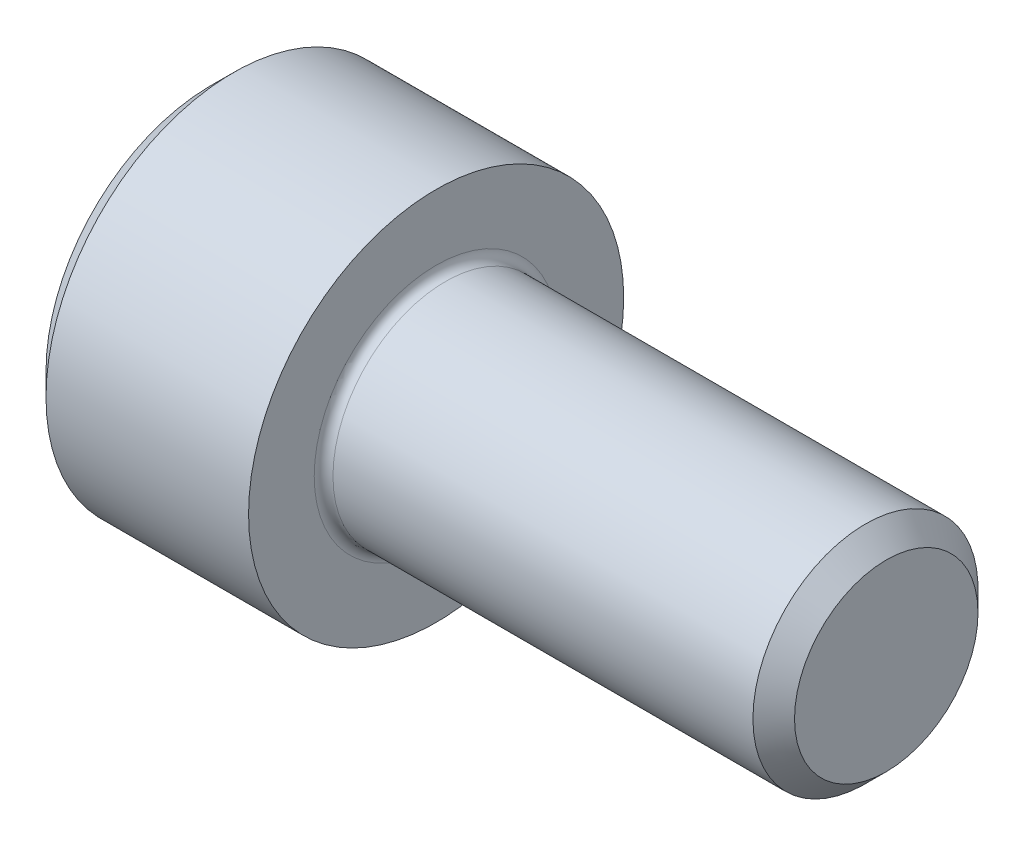
ISO-10303-21;
HEADER;
FILE_DESCRIPTION(('STEP AP214'),'2;1');
FILE_NAME('part.step','',(''),(''),'','','');
FILE_SCHEMA(('AUTOMOTIVE_DESIGN { 1 0 10303 214 1 1 1 1 }'));
ENDSEC;
DATA;
#1=APPLICATION_CONTEXT('core data for automotive mechanical design processes');
#2=APPLICATION_PROTOCOL_DEFINITION('international standard','automotive_design',2000,#1);
#3=PRODUCT_CONTEXT('',#1,'mechanical');
#4=PRODUCT('Part','Part','',(#3));
#5=PRODUCT_RELATED_PRODUCT_CATEGORY('part','',(#4));
#6=PRODUCT_DEFINITION_FORMATION('','',#4);
#7=PRODUCT_DEFINITION_CONTEXT('part definition',#1,'design');
#8=PRODUCT_DEFINITION('design','',#6,#7);
#9=PRODUCT_DEFINITION_SHAPE('','',#8);
#10=(LENGTH_UNIT() NAMED_UNIT(*) SI_UNIT(.MILLI.,.METRE.));
#11=(NAMED_UNIT(*) PLANE_ANGLE_UNIT() SI_UNIT($,.RADIAN.));
#12=(NAMED_UNIT(*) SI_UNIT($,.STERADIAN.) SOLID_ANGLE_UNIT());
#13=UNCERTAINTY_MEASURE_WITH_UNIT(LENGTH_MEASURE(1.E-05),#10,'distance_accuracy_value','');
#14=(GEOMETRIC_REPRESENTATION_CONTEXT(3) GLOBAL_UNCERTAINTY_ASSIGNED_CONTEXT((#13)) GLOBAL_UNIT_ASSIGNED_CONTEXT((#10,
#11,#12)) REPRESENTATION_CONTEXT('',''));
#15=CARTESIAN_POINT('',(0.,0.,0.));
#16=DIRECTION('',(0.,0.,1.));
#17=DIRECTION('',(1.,0.,0.));
#18=AXIS2_PLACEMENT_3D('',#15,#16,#17);
#19=CARTESIAN_POINT('',(0.,0.,0.));
#20=DIRECTION('',(-1.,0.,0.));
#21=DIRECTION('',(0.,0.,1.));
#22=AXIS2_PLACEMENT_3D('',#19,#20,#21);
#23=PLANE('',#22);
#24=DIRECTION('',(0.,-0.499999999999999,0.866025403784439));
#25=VECTOR('',#24,1.);
#26=CARTESIAN_POINT('',(0.,2.93524876856006,0.));
#27=LINE('',#26,#25);
#28=CARTESIAN_POINT('',(0.,2.93524876856006,0.));
#29=VERTEX_POINT('',#28);
#30=CARTESIAN_POINT('',(0.,1.46762438428003,2.542));
#31=VERTEX_POINT('',#30);
#32=EDGE_CURVE('E274',#29,#31,#27,.T.);
#33=ORIENTED_EDGE('',*,*,#32,.T.);
#34=DIRECTION('',(0.,1.,0.));
#35=VECTOR('',#34,1.);
#36=CARTESIAN_POINT('',(0.,-1.46762438428003,2.542));
#37=LINE('',#36,#35);
#38=CARTESIAN_POINT('',(0.,-1.46762438428003,2.542));
#39=VERTEX_POINT('',#38);
#40=EDGE_CURVE('E131',#39,#31,#37,.T.);
#41=ORIENTED_EDGE('',*,*,#40,.F.);
#42=DIRECTION('',(0.,-0.500000000000001,-0.866025403784438));
#43=VECTOR('',#42,1.);
#44=CARTESIAN_POINT('',(0.,-1.46762438428003,2.542));
#45=LINE('',#44,#43);
#46=CARTESIAN_POINT('',(0.,-2.93524876856006,0.));
#47=VERTEX_POINT('',#46);
#48=EDGE_CURVE('E277',#39,#47,#45,.T.);
#49=ORIENTED_EDGE('',*,*,#48,.T.);
#50=DIRECTION('',(0.,0.499999999999999,-0.866025403784439));
#51=VECTOR('',#50,1.);
#52=CARTESIAN_POINT('',(0.,-2.93524876856006,0.));
#53=LINE('',#52,#51);
#54=CARTESIAN_POINT('',(0.,-1.46762438428003,-2.542));
#55=VERTEX_POINT('',#54);
#56=EDGE_CURVE('E280',#47,#55,#53,.T.);
#57=ORIENTED_EDGE('',*,*,#56,.T.);
#58=DIRECTION('',(0.,-1.,0.));
#59=VECTOR('',#58,1.);
#60=CARTESIAN_POINT('',(0.,1.46762438428002,-2.542));
#61=LINE('',#60,#59);
#62=CARTESIAN_POINT('',(0.,1.46762438428002,-2.542));
#63=VERTEX_POINT('',#62);
#64=EDGE_CURVE('E283',#63,#55,#61,.T.);
#65=ORIENTED_EDGE('',*,*,#64,.F.);
#66=DIRECTION('',(0.,-0.500000000000001,-0.866025403784438));
#67=VECTOR('',#66,1.);
#68=CARTESIAN_POINT('',(0.,2.93524876856006,0.));
#69=LINE('',#68,#67);
#70=EDGE_CURVE('E126',#29,#63,#69,.T.);
#71=ORIENTED_EDGE('',*,*,#70,.F.);
#72=EDGE_LOOP('',(#33,#41,#49,#57,#65,#71));
#73=FACE_BOUND('',#72,.T.);
#74=CARTESIAN_POINT('',(0.,0.,0.));
#75=DIRECTION('',(-1.,0.,0.));
#76=DIRECTION('',(0.,0.,1.));
#77=AXIS2_PLACEMENT_3D('',#74,#75,#76);
#78=CIRCLE('',#77,4.4);
#79=CARTESIAN_POINT('',(0.,0.,4.4));
#80=VERTEX_POINT('',#79);
#81=EDGE_CURVE('E148',#80,#80,#78,.T.);
#82=ORIENTED_EDGE('',*,*,#81,.T.);
#83=EDGE_LOOP('',(#82));
#84=FACE_BOUND('',#83,.T.);
#85=ADVANCED_FACE('F38',(#73,#84),#23,.T.);
#86=CARTESIAN_POINT('',(18.,2.4455,0.));
#87=DIRECTION('',(1.,0.,0.));
#88=DIRECTION('',(0.,0.,-1.));
#89=AXIS2_PLACEMENT_3D('',#86,#87,#88);
#90=PLANE('',#89);
#91=CARTESIAN_POINT('',(18.,0.,0.));
#92=DIRECTION('',(-1.,0.,0.));
#93=DIRECTION('',(0.,0.,1.));
#94=AXIS2_PLACEMENT_3D('',#91,#92,#93);
#95=CIRCLE('',#94,2.4455);
#96=CARTESIAN_POINT('',(18.,0.,2.4455));
#97=VERTEX_POINT('',#96);
#98=EDGE_CURVE('E164',#97,#97,#95,.T.);
#99=ORIENTED_EDGE('',*,*,#98,.F.);
#100=EDGE_LOOP('',(#99));
#101=FACE_BOUND('',#100,.T.);
#102=ADVANCED_FACE('F188',(#101),#90,.T.);
#103=CARTESIAN_POINT('',(18.,0.,0.));
#104=DIRECTION('',(-1.,0.,0.));
#105=DIRECTION('',(0.,0.,1.));
#106=AXIS2_PLACEMENT_3D('',#103,#104,#105);
#107=CONICAL_SURFACE('',#106,2.4455,0.785398163397383);
#108=CARTESIAN_POINT('',(17.4455,0.,0.));
#109=DIRECTION('',(-1.,0.,0.));
#110=DIRECTION('',(0.,0.,1.));
#111=AXIS2_PLACEMENT_3D('',#108,#109,#110);
#112=CIRCLE('',#111,2.99999999999995);
#113=CARTESIAN_POINT('',(17.4455,0.,2.99999999999995));
#114=VERTEX_POINT('',#113);
#115=EDGE_CURVE('E160',#114,#114,#112,.T.);
#116=ORIENTED_EDGE('',*,*,#115,.F.);
#117=EDGE_LOOP('',(#116));
#118=FACE_BOUND('',#117,.T.);
#119=ORIENTED_EDGE('',*,*,#98,.T.);
#120=EDGE_LOOP('',(#119));
#121=FACE_BOUND('',#120,.T.);
#122=ADVANCED_FACE('F194',(#118,#121),#107,.T.);
#123=CARTESIAN_POINT('',(-31.75,0.,0.));
#124=DIRECTION('',(-1.,0.,0.));
#125=DIRECTION('',(0.,0.,1.));
#126=AXIS2_PLACEMENT_3D('',#123,#124,#125);
#127=CYLINDRICAL_SURFACE('',#126,2.99999999999998);
#128=CARTESIAN_POINT('',(6.25,0.,0.));
#129=DIRECTION('',(1.,0.,0.));
#130=DIRECTION('',(0.,0.,-1.));
#131=AXIS2_PLACEMENT_3D('',#128,#129,#130);
#132=CIRCLE('',#131,2.99999999999998);
#133=CARTESIAN_POINT('',(6.25,0.,-2.99999999999998));
#134=VERTEX_POINT('',#133);
#135=EDGE_CURVE('E11',#134,#134,#132,.T.);
#136=ORIENTED_EDGE('',*,*,#135,.T.);
#137=EDGE_LOOP('',(#136));
#138=FACE_BOUND('',#137,.T.);
#139=ORIENTED_EDGE('',*,*,#115,.T.);
#140=EDGE_LOOP('',(#139));
#141=FACE_BOUND('',#140,.T.);
#142=ADVANCED_FACE('F205',(#138,#141),#127,.T.);
#143=CARTESIAN_POINT('',(6.,5.,0.));
#144=DIRECTION('',(1.,0.,0.));
#145=DIRECTION('',(0.,0.,-1.));
#146=AXIS2_PLACEMENT_3D('',#143,#144,#145);
#147=PLANE('',#146);
#148=CARTESIAN_POINT('',(6.,0.,0.));
#149=DIRECTION('',(1.,0.,0.));
#150=DIRECTION('',(0.,0.,-1.));
#151=AXIS2_PLACEMENT_3D('',#148,#149,#150);
#152=CIRCLE('',#151,3.24999999999998);
#153=CARTESIAN_POINT('',(6.,0.,-3.24999999999998));
#154=VERTEX_POINT('',#153);
#155=EDGE_CURVE('E47',#154,#154,#152,.F.);
#156=ORIENTED_EDGE('',*,*,#155,.T.);
#157=EDGE_LOOP('',(#156));
#158=FACE_BOUND('',#157,.T.);
#159=CARTESIAN_POINT('',(6.,0.,0.));
#160=DIRECTION('',(-1.,0.,0.));
#161=DIRECTION('',(0.,0.,1.));
#162=AXIS2_PLACEMENT_3D('',#159,#160,#161);
#163=CIRCLE('',#162,5.);
#164=CARTESIAN_POINT('',(6.,0.,5.));
#165=VERTEX_POINT('',#164);
#166=EDGE_CURVE('E156',#165,#165,#163,.T.);
#167=ORIENTED_EDGE('',*,*,#166,.F.);
#168=EDGE_LOOP('',(#167));
#169=FACE_BOUND('',#168,.T.);
#170=ADVANCED_FACE('F172',(#158,#169),#147,.T.);
#171=CARTESIAN_POINT('',(-31.75,0.,0.));
#172=DIRECTION('',(-1.,0.,0.));
#173=DIRECTION('',(0.,0.,1.));
#174=AXIS2_PLACEMENT_3D('',#171,#172,#173);
#175=CYLINDRICAL_SURFACE('',#174,5.);
#176=ORIENTED_EDGE('',*,*,#166,.T.);
#177=EDGE_LOOP('',(#176));
#178=FACE_BOUND('',#177,.T.);
#179=CARTESIAN_POINT('',(0.600000000000003,0.,0.));
#180=DIRECTION('',(-1.,0.,0.));
#181=DIRECTION('',(0.,0.,1.));
#182=AXIS2_PLACEMENT_3D('',#179,#180,#181);
#183=CIRCLE('',#182,5.);
#184=CARTESIAN_POINT('',(0.600000000000003,0.,5.));
#185=VERTEX_POINT('',#184);
#186=EDGE_CURVE('E152',#185,#185,#183,.T.);
#187=ORIENTED_EDGE('',*,*,#186,.F.);
#188=EDGE_LOOP('',(#187));
#189=FACE_BOUND('',#188,.T.);
#190=ADVANCED_FACE('F183',(#178,#189),#175,.T.);
#191=CARTESIAN_POINT('',(0.,0.,0.));
#192=DIRECTION('',(1.,0.,0.));
#193=DIRECTION('',(0.,0.,-1.));
#194=AXIS2_PLACEMENT_3D('',#191,#192,#193);
#195=CONICAL_SURFACE('',#194,4.4,0.785398163397442);
#196=ORIENTED_EDGE('',*,*,#186,.T.);
#197=EDGE_LOOP('',(#196));
#198=FACE_BOUND('',#197,.T.);
#199=ORIENTED_EDGE('',*,*,#81,.F.);
#200=EDGE_LOOP('',(#199));
#201=FACE_BOUND('',#200,.T.);
#202=ADVANCED_FACE('F176',(#198,#201),#195,.T.);
#203=CARTESIAN_POINT('',(6.25,0.,0.));
#204=DIRECTION('',(1.,0.,0.));
#205=DIRECTION('',(0.,0.,-1.));
#206=AXIS2_PLACEMENT_3D('',#203,#204,#205);
#207=TOROIDAL_SURFACE('',#206,3.24999999999998,0.25);
#208=ORIENTED_EDGE('',*,*,#135,.F.);
#209=EDGE_LOOP('',(#208));
#210=FACE_BOUND('',#209,.T.);
#211=ORIENTED_EDGE('',*,*,#155,.F.);
#212=EDGE_LOOP('',(#211));
#213=FACE_BOUND('',#212,.T.);
#214=ADVANCED_FACE('F40',(#210,#213),#207,.F.);
#215=CARTESIAN_POINT('',(3.,2.93524876856006,0.));
#216=DIRECTION('',(0.,-0.866025403784439,-0.499999999999999));
#217=DIRECTION('',(0.,0.499999999999999,-0.866025403784439));
#218=AXIS2_PLACEMENT_3D('',#215,#216,#217);
#219=PLANE('',#218);
#220=ORIENTED_EDGE('',*,*,#32,.F.);
#221=DIRECTION('',(-1.,0.,0.));
#222=VECTOR('',#221,1.);
#223=CARTESIAN_POINT('',(3.,2.93524876856006,0.));
#224=LINE('',#223,#222);
#225=CARTESIAN_POINT('',(3.,2.93524876856006,0.));
#226=VERTEX_POINT('',#225);
#227=EDGE_CURVE('E273',#226,#29,#224,.T.);
#228=ORIENTED_EDGE('',*,*,#227,.F.);
#229=DIRECTION('',(0.,-0.499999999999999,0.866025403784439));
#230=VECTOR('',#229,1.);
#231=CARTESIAN_POINT('',(3.,2.93524876856006,0.));
#232=LINE('',#231,#230);
#233=CARTESIAN_POINT('',(3.,2.20143657642005,1.271));
#234=VERTEX_POINT('',#233);
#235=EDGE_CURVE('E54',#226,#234,#232,.T.);
#236=ORIENTED_EDGE('',*,*,#235,.T.);
#237=CARTESIAN_POINT('',(3.,1.46762438428003,2.542));
#238=VERTEX_POINT('',#237);
#239=EDGE_CURVE('E112',#234,#238,#232,.T.);
#240=ORIENTED_EDGE('',*,*,#239,.T.);
#241=DIRECTION('',(-1.,0.,0.));
#242=VECTOR('',#241,1.);
#243=CARTESIAN_POINT('',(3.,1.46762438428003,2.542));
#244=LINE('',#243,#242);
#245=EDGE_CURVE('E124',#238,#31,#244,.T.);
#246=ORIENTED_EDGE('',*,*,#245,.T.);
#247=EDGE_LOOP('',(#220,#228,#236,#240,#246));
#248=FACE_BOUND('',#247,.T.);
#249=ADVANCED_FACE('F123',(#248),#219,.T.);
#250=CARTESIAN_POINT('',(3.,-1.46762438428003,2.542));
#251=DIRECTION('',(0.,0.,1.));
#252=DIRECTION('',(0.,-1.,0.));
#253=AXIS2_PLACEMENT_3D('',#250,#251,#252);
#254=PLANE('',#253);
#255=ORIENTED_EDGE('',*,*,#40,.T.);
#256=ORIENTED_EDGE('',*,*,#245,.F.);
#257=DIRECTION('',(0.,1.,0.));
#258=VECTOR('',#257,1.);
#259=CARTESIAN_POINT('',(3.,-1.46762438428003,2.542));
#260=LINE('',#259,#258);
#261=CARTESIAN_POINT('',(3.,0.,2.542));
#262=VERTEX_POINT('',#261);
#263=EDGE_CURVE('E110',#262,#238,#260,.T.);
#264=ORIENTED_EDGE('',*,*,#263,.F.);
#265=CARTESIAN_POINT('',(3.,-1.46762438428003,2.542));
#266=VERTEX_POINT('',#265);
#267=EDGE_CURVE('E120',#266,#262,#260,.T.);
#268=ORIENTED_EDGE('',*,*,#267,.F.);
#269=DIRECTION('',(-1.,0.,0.));
#270=VECTOR('',#269,1.);
#271=CARTESIAN_POINT('',(3.,-1.46762438428003,2.542));
#272=LINE('',#271,#270);
#273=EDGE_CURVE('E134',#266,#39,#272,.T.);
#274=ORIENTED_EDGE('',*,*,#273,.T.);
#275=EDGE_LOOP('',(#255,#256,#264,#268,#274));
#276=FACE_BOUND('',#275,.T.);
#277=ADVANCED_FACE('F128',(#276),#254,.F.);
#278=CARTESIAN_POINT('',(3.,-1.46762438428003,2.542));
#279=DIRECTION('',(0.,0.866025403784438,-0.500000000000001));
#280=DIRECTION('',(0.,0.500000000000001,0.866025403784438));
#281=AXIS2_PLACEMENT_3D('',#278,#279,#280);
#282=PLANE('',#281);
#283=ORIENTED_EDGE('',*,*,#48,.F.);
#284=ORIENTED_EDGE('',*,*,#273,.F.);
#285=DIRECTION('',(0.,-0.500000000000001,-0.866025403784438));
#286=VECTOR('',#285,1.);
#287=CARTESIAN_POINT('',(3.,-1.46762438428003,2.542));
#288=LINE('',#287,#286);
#289=CARTESIAN_POINT('',(3.,-2.20143657642004,1.271));
#290=VERTEX_POINT('',#289);
#291=EDGE_CURVE('E327',#266,#290,#288,.T.);
#292=ORIENTED_EDGE('',*,*,#291,.T.);
#293=CARTESIAN_POINT('',(3.,-2.93524876856006,0.));
#294=VERTEX_POINT('',#293);
#295=EDGE_CURVE('E299',#290,#294,#288,.T.);
#296=ORIENTED_EDGE('',*,*,#295,.T.);
#297=DIRECTION('',(-1.,0.,0.));
#298=VECTOR('',#297,1.);
#299=CARTESIAN_POINT('',(3.,-2.93524876856006,0.));
#300=LINE('',#299,#298);
#301=EDGE_CURVE('E143',#294,#47,#300,.T.);
#302=ORIENTED_EDGE('',*,*,#301,.T.);
#303=EDGE_LOOP('',(#283,#284,#292,#296,#302));
#304=FACE_BOUND('',#303,.T.);
#305=ADVANCED_FACE('F296',(#304),#282,.T.);
#306=CARTESIAN_POINT('',(3.,-2.93524876856006,0.));
#307=DIRECTION('',(0.,0.866025403784439,0.499999999999999));
#308=DIRECTION('',(0.,-0.499999999999999,0.866025403784439));
#309=AXIS2_PLACEMENT_3D('',#306,#307,#308);
#310=PLANE('',#309);
#311=ORIENTED_EDGE('',*,*,#56,.F.);
#312=ORIENTED_EDGE('',*,*,#301,.F.);
#313=DIRECTION('',(0.,0.499999999999999,-0.866025403784439));
#314=VECTOR('',#313,1.);
#315=CARTESIAN_POINT('',(3.,-2.93524876856006,0.));
#316=LINE('',#315,#314);
#317=CARTESIAN_POINT('',(3.,-2.20143657642005,-1.271));
#318=VERTEX_POINT('',#317);
#319=EDGE_CURVE('E268',#294,#318,#316,.T.);
#320=ORIENTED_EDGE('',*,*,#319,.T.);
#321=CARTESIAN_POINT('',(3.,-1.46762438428003,-2.542));
#322=VERTEX_POINT('',#321);
#323=EDGE_CURVE('E323',#318,#322,#316,.T.);
#324=ORIENTED_EDGE('',*,*,#323,.T.);
#325=DIRECTION('',(-1.,0.,0.));
#326=VECTOR('',#325,1.);
#327=CARTESIAN_POINT('',(3.,-1.46762438428003,-2.542));
#328=LINE('',#327,#326);
#329=EDGE_CURVE('E242',#322,#55,#328,.T.);
#330=ORIENTED_EDGE('',*,*,#329,.T.);
#331=EDGE_LOOP('',(#311,#312,#320,#324,#330));
#332=FACE_BOUND('',#331,.T.);
#333=ADVANCED_FACE('F328',(#332),#310,.T.);
#334=CARTESIAN_POINT('',(3.,1.46762438428002,-2.542));
#335=DIRECTION('',(0.,0.,-1.));
#336=DIRECTION('',(0.,1.,0.));
#337=AXIS2_PLACEMENT_3D('',#334,#335,#336);
#338=PLANE('',#337);
#339=ORIENTED_EDGE('',*,*,#64,.T.);
#340=ORIENTED_EDGE('',*,*,#329,.F.);
#341=DIRECTION('',(0.,-1.,0.));
#342=VECTOR('',#341,1.);
#343=CARTESIAN_POINT('',(3.,1.46762438428002,-2.542));
#344=LINE('',#343,#342);
#345=CARTESIAN_POINT('',(3.,0.,-2.542));
#346=VERTEX_POINT('',#345);
#347=EDGE_CURVE('E260',#346,#322,#344,.T.);
#348=ORIENTED_EDGE('',*,*,#347,.F.);
#349=CARTESIAN_POINT('',(3.,1.46762438428002,-2.542));
#350=VERTEX_POINT('',#349);
#351=EDGE_CURVE('E256',#350,#346,#344,.T.);
#352=ORIENTED_EDGE('',*,*,#351,.F.);
#353=DIRECTION('',(-1.,0.,0.));
#354=VECTOR('',#353,1.);
#355=CARTESIAN_POINT('',(3.,1.46762438428002,-2.542));
#356=LINE('',#355,#354);
#357=EDGE_CURVE('E248',#350,#63,#356,.T.);
#358=ORIENTED_EDGE('',*,*,#357,.T.);
#359=EDGE_LOOP('',(#339,#340,#348,#352,#358));
#360=FACE_BOUND('',#359,.T.);
#361=ADVANCED_FACE('F330',(#360),#338,.F.);
#362=CARTESIAN_POINT('',(3.,2.93524876856006,0.));
#363=DIRECTION('',(0.,0.866025403784438,-0.500000000000001));
#364=DIRECTION('',(0.,0.500000000000001,0.866025403784438));
#365=AXIS2_PLACEMENT_3D('',#362,#363,#364);
#366=PLANE('',#365);
#367=ORIENTED_EDGE('',*,*,#70,.T.);
#368=ORIENTED_EDGE('',*,*,#357,.F.);
#369=DIRECTION('',(0.,-0.500000000000001,-0.866025403784438));
#370=VECTOR('',#369,1.);
#371=CARTESIAN_POINT('',(3.,2.93524876856006,0.));
#372=LINE('',#371,#370);
#373=CARTESIAN_POINT('',(3.,2.20143657642004,-1.271));
#374=VERTEX_POINT('',#373);
#375=EDGE_CURVE('E259',#374,#350,#372,.T.);
#376=ORIENTED_EDGE('',*,*,#375,.F.);
#377=EDGE_CURVE('E266',#226,#374,#372,.T.);
#378=ORIENTED_EDGE('',*,*,#377,.F.);
#379=ORIENTED_EDGE('',*,*,#227,.T.);
#380=EDGE_LOOP('',(#367,#368,#376,#378,#379));
#381=FACE_BOUND('',#380,.T.);
#382=ADVANCED_FACE('F309',(#381),#366,.F.);
#383=CARTESIAN_POINT('',(3.,1.46762438428003,2.542));
#384=DIRECTION('',(-1.,0.,0.));
#385=DIRECTION('',(0.,0.,1.));
#386=AXIS2_PLACEMENT_3D('',#383,#384,#385);
#387=PLANE('',#386);
#388=CARTESIAN_POINT('',(3.,0.,0.));
#389=DIRECTION('',(-1.,0.,0.));
#390=DIRECTION('',(0.,0.,1.));
#391=AXIS2_PLACEMENT_3D('',#388,#389,#390);
#392=CIRCLE('',#391,2.542);
#393=EDGE_CURVE('E133',#290,#262,#392,.T.);
#394=ORIENTED_EDGE('',*,*,#393,.F.);
#395=ORIENTED_EDGE('',*,*,#291,.F.);
#396=ORIENTED_EDGE('',*,*,#267,.T.);
#397=EDGE_LOOP('',(#394,#395,#396));
#398=FACE_BOUND('',#397,.T.);
#399=ADVANCED_FACE('F369',(#398),#387,.T.);
#400=EDGE_CURVE('E141',#318,#290,#392,.T.);
#401=ORIENTED_EDGE('',*,*,#400,.F.);
#402=ORIENTED_EDGE('',*,*,#319,.F.);
#403=ORIENTED_EDGE('',*,*,#295,.F.);
#404=EDGE_LOOP('',(#401,#402,#403));
#405=FACE_BOUND('',#404,.T.);
#406=ADVANCED_FACE('F320',(#405),#387,.T.);
#407=EDGE_CURVE('E314',#346,#318,#392,.T.);
#408=ORIENTED_EDGE('',*,*,#407,.F.);
#409=ORIENTED_EDGE('',*,*,#347,.T.);
#410=ORIENTED_EDGE('',*,*,#323,.F.);
#411=EDGE_LOOP('',(#408,#409,#410));
#412=FACE_BOUND('',#411,.T.);
#413=ADVANCED_FACE('F324',(#412),#387,.T.);
#414=EDGE_CURVE('E252',#374,#346,#392,.T.);
#415=ORIENTED_EDGE('',*,*,#414,.F.);
#416=ORIENTED_EDGE('',*,*,#375,.T.);
#417=ORIENTED_EDGE('',*,*,#351,.T.);
#418=EDGE_LOOP('',(#415,#416,#417));
#419=FACE_BOUND('',#418,.T.);
#420=ADVANCED_FACE('F311',(#419),#387,.T.);
#421=EDGE_CURVE('E149',#234,#374,#392,.T.);
#422=ORIENTED_EDGE('',*,*,#421,.F.);
#423=ORIENTED_EDGE('',*,*,#235,.F.);
#424=ORIENTED_EDGE('',*,*,#377,.T.);
#425=EDGE_LOOP('',(#422,#423,#424));
#426=FACE_BOUND('',#425,.T.);
#427=ADVANCED_FACE('F307',(#426),#387,.T.);
#428=EDGE_CURVE('E115',#262,#234,#392,.T.);
#429=ORIENTED_EDGE('',*,*,#428,.F.);
#430=ORIENTED_EDGE('',*,*,#263,.T.);
#431=ORIENTED_EDGE('',*,*,#239,.F.);
#432=EDGE_LOOP('',(#429,#430,#431));
#433=FACE_BOUND('',#432,.T.);
#434=ADVANCED_FACE('F111',(#433),#387,.T.);
#435=CARTESIAN_POINT('',(3.,0.,0.));
#436=DIRECTION('',(-1.,0.,0.));
#437=DIRECTION('',(0.,0.,1.));
#438=AXIS2_PLACEMENT_3D('',#435,#436,#437);
#439=CONICAL_SURFACE('',#438,2.542,1.04719755119659);
#440=CARTESIAN_POINT('',(4.46762438428004,0.,0.));
#441=VERTEX_POINT('',#440);
#442=VERTEX_LOOP('',#441);
#443=FACE_BOUND('',#442,.T.);
#444=ORIENTED_EDGE('',*,*,#428,.T.);
#445=ORIENTED_EDGE('',*,*,#421,.T.);
#446=ORIENTED_EDGE('',*,*,#414,.T.);
#447=ORIENTED_EDGE('',*,*,#407,.T.);
#448=ORIENTED_EDGE('',*,*,#400,.T.);
#449=ORIENTED_EDGE('',*,*,#393,.T.);
#450=EDGE_LOOP('',(#444,#445,#446,#447,#448,#449));
#451=FACE_BOUND('',#450,.T.);
#452=ADVANCED_FACE('F198',(#443,#451),#439,.F.);
#453=CLOSED_SHELL('',(#85,#102,#122,#142,#170,#190,#202,#214,#249,#277,#305,#333,#361,#382,#399,
#406,#413,#420,#427,#434,#452));
#454=MANIFOLD_SOLID_BREP('B2',#453);
#455=ADVANCED_BREP_SHAPE_REPRESENTATION('',(#18,#454),#14);
#456=SHAPE_DEFINITION_REPRESENTATION(#9,#455);
ENDSEC;
END-ISO-10303-21;
